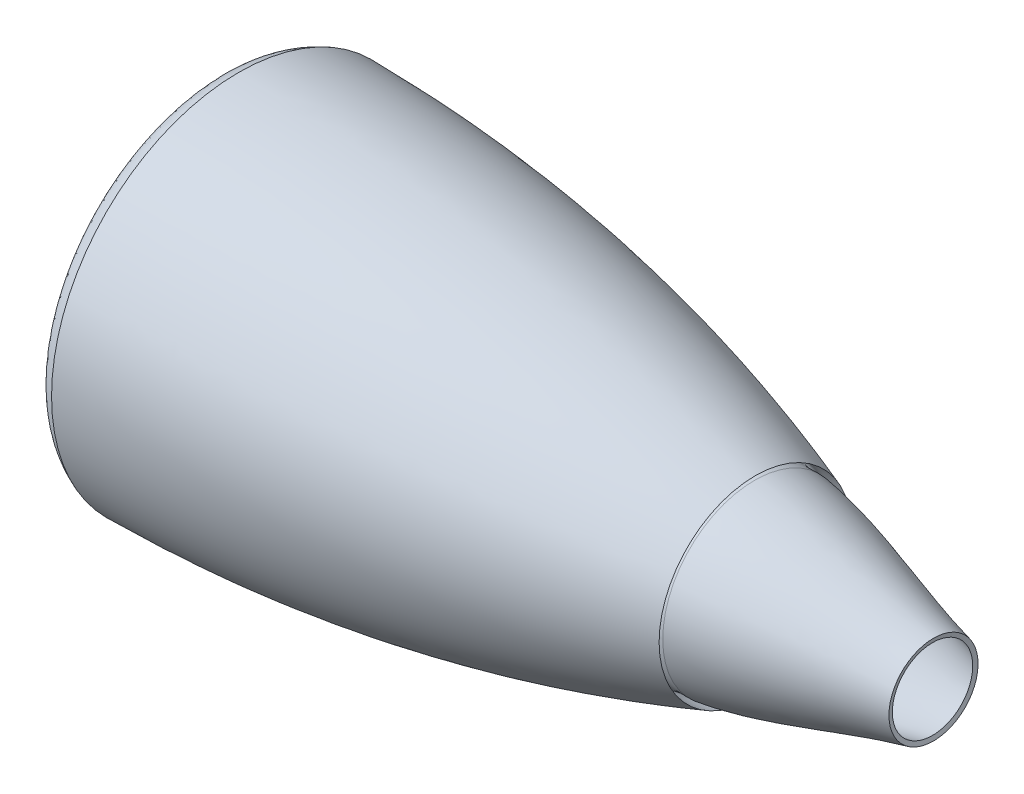
ISO-10303-21;
HEADER;
FILE_DESCRIPTION(('STEP AP214'),'2;1');
FILE_NAME('part.step','',(''),(''),'','','');
FILE_SCHEMA(('AUTOMOTIVE_DESIGN { 1 0 10303 214 1 1 1 1 }'));
ENDSEC;
DATA;
#1=APPLICATION_CONTEXT('core data for automotive mechanical design processes');
#2=APPLICATION_PROTOCOL_DEFINITION('international standard','automotive_design',2000,#1);
#3=PRODUCT_CONTEXT('',#1,'mechanical');
#4=PRODUCT('Part','Part','',(#3));
#5=PRODUCT_RELATED_PRODUCT_CATEGORY('part','',(#4));
#6=PRODUCT_DEFINITION_FORMATION('','',#4);
#7=PRODUCT_DEFINITION_CONTEXT('part definition',#1,'design');
#8=PRODUCT_DEFINITION('design','',#6,#7);
#9=PRODUCT_DEFINITION_SHAPE('','',#8);
#10=(LENGTH_UNIT() NAMED_UNIT(*) SI_UNIT(.MILLI.,.METRE.));
#11=(NAMED_UNIT(*) PLANE_ANGLE_UNIT() SI_UNIT($,.RADIAN.));
#12=(NAMED_UNIT(*) SI_UNIT($,.STERADIAN.) SOLID_ANGLE_UNIT());
#13=UNCERTAINTY_MEASURE_WITH_UNIT(LENGTH_MEASURE(1.E-05),#10,'distance_accuracy_value','');
#14=(GEOMETRIC_REPRESENTATION_CONTEXT(3) GLOBAL_UNCERTAINTY_ASSIGNED_CONTEXT((#13)) GLOBAL_UNIT_ASSIGNED_CONTEXT((#10,
#11,#12)) REPRESENTATION_CONTEXT('',''));
#15=CARTESIAN_POINT('',(0.,0.,0.));
#16=DIRECTION('',(0.,0.,1.));
#17=DIRECTION('',(1.,0.,0.));
#18=AXIS2_PLACEMENT_3D('',#15,#16,#17);
#19=CARTESIAN_POINT('',(780.,0.,0.));
#20=DIRECTION('',(1.,0.,0.));
#21=DIRECTION('',(0.,0.,-1.));
#22=AXIS2_PLACEMENT_3D('',#19,#20,#21);
#23=CONICAL_SURFACE('',#22,50.,1.35127852830754);
#24=CARTESIAN_POINT('',(778.911204907492,0.,0.));
#25=DIRECTION('',(-1.,0.,0.));
#26=DIRECTION('',(0.,1.,0.));
#27=AXIS2_PLACEMENT_3D('',#24,#25,#26);
#28=CIRCLE('',#27,45.1199871673806);
#29=CARTESIAN_POINT('',(778.911204907492,45.1199871673806,0.));
#30=VERTEX_POINT('',#29);
#31=EDGE_CURVE('E61',#30,#30,#28,.T.);
#32=ORIENTED_EDGE('',*,*,#31,.T.);
#33=EDGE_LOOP('',(#32));
#34=FACE_BOUND('',#33,.T.);
#35=CARTESIAN_POINT('',(780.,0.,0.));
#36=DIRECTION('',(-1.,0.,0.));
#37=DIRECTION('',(0.,0.,1.));
#38=AXIS2_PLACEMENT_3D('',#35,#36,#37);
#39=CIRCLE('',#38,50.);
#40=CARTESIAN_POINT('',(780.,0.,50.));
#41=VERTEX_POINT('',#40);
#42=EDGE_CURVE('E172',#41,#41,#39,.T.);
#43=ORIENTED_EDGE('',*,*,#42,.F.);
#44=EDGE_LOOP('',(#43));
#45=FACE_BOUND('',#44,.T.);
#46=ADVANCED_FACE('F43',(#34,#45),#23,.F.);
#47=CARTESIAN_POINT('',(55.,0.,0.));
#48=DIRECTION('',(1.,0.,0.));
#49=DIRECTION('',(0.,0.,-1.));
#50=AXIS2_PLACEMENT_3D('',#47,#48,#49);
#51=PLANE('',#50);
#52=CARTESIAN_POINT('',(55.,0.,0.));
#53=DIRECTION('',(-1.,0.,0.));
#54=DIRECTION('',(0.,0.,1.));
#55=AXIS2_PLACEMENT_3D('',#52,#53,#54);
#56=CIRCLE('',#55,195.);
#57=CARTESIAN_POINT('',(55.,0.,195.));
#58=VERTEX_POINT('',#57);
#59=EDGE_CURVE('E50',#58,#58,#56,.T.);
#60=ORIENTED_EDGE('',*,*,#59,.F.);
#61=EDGE_LOOP('',(#60));
#62=FACE_BOUND('',#61,.T.);
#63=CARTESIAN_POINT('',(55.,0.,0.));
#64=DIRECTION('',(-1.,0.,0.));
#65=DIRECTION('',(0.,0.,1.));
#66=AXIS2_PLACEMENT_3D('',#63,#64,#65);
#67=CIRCLE('',#66,190.);
#68=CARTESIAN_POINT('',(55.,0.,190.));
#69=VERTEX_POINT('',#68);
#70=EDGE_CURVE('E64',#69,#69,#67,.T.);
#71=ORIENTED_EDGE('',*,*,#70,.T.);
#72=EDGE_LOOP('',(#71));
#73=FACE_BOUND('',#72,.T.);
#74=ADVANCED_FACE('F140',(#62,#73),#51,.T.);
#75=CARTESIAN_POINT('',(912.992076059544,0.,0.));
#76=DIRECTION('',(-1.,0.,0.));
#77=DIRECTION('',(0.,0.,1.));
#78=AXIS2_PLACEMENT_3D('',#75,#76,#77);
#79=CYLINDRICAL_SURFACE('',#78,195.);
#80=ORIENTED_EDGE('',*,*,#59,.T.);
#81=EDGE_LOOP('',(#80));
#82=FACE_BOUND('',#81,.T.);
#83=CARTESIAN_POINT('',(26.9098300562506,0.,0.));
#84=DIRECTION('',(1.,0.,0.));
#85=DIRECTION('',(0.,0.,-1.));
#86=AXIS2_PLACEMENT_3D('',#83,#84,#85);
#87=CIRCLE('',#86,195.);
#88=CARTESIAN_POINT('',(26.9098300562506,0.,-195.));
#89=VERTEX_POINT('',#88);
#90=EDGE_CURVE('E55',#89,#89,#87,.F.);
#91=ORIENTED_EDGE('',*,*,#90,.F.);
#92=EDGE_LOOP('',(#91));
#93=FACE_BOUND('',#92,.T.);
#94=ADVANCED_FACE('F142',(#82,#93),#79,.T.);
#95=CARTESIAN_POINT('',(20.5278640450005,0.,0.));
#96=DIRECTION('',(1.,0.,0.));
#97=DIRECTION('',(0.,0.,-1.));
#98=AXIS2_PLACEMENT_3D('',#95,#96,#97);
#99=CONICAL_SURFACE('',#98,182.2360679775,1.10714871779409);
#100=ORIENTED_EDGE('',*,*,#90,.T.);
#101=EDGE_LOOP('',(#100));
#102=FACE_BOUND('',#101,.T.);
#103=CARTESIAN_POINT('',(21.9098300562506,0.,0.));
#104=DIRECTION('',(1.,0.,0.));
#105=DIRECTION('',(0.,0.,-1.));
#106=AXIS2_PLACEMENT_3D('',#103,#104,#105);
#107=CIRCLE('',#106,185.);
#108=CARTESIAN_POINT('',(21.9098300562506,0.,-185.));
#109=VERTEX_POINT('',#108);
#110=EDGE_CURVE('E193',#109,#109,#107,.F.);
#111=ORIENTED_EDGE('',*,*,#110,.F.);
#112=EDGE_LOOP('',(#111));
#113=FACE_BOUND('',#112,.T.);
#114=ADVANCED_FACE('F148',(#102,#113),#99,.T.);
#115=CARTESIAN_POINT('',(912.992076059544,0.,0.));
#116=DIRECTION('',(-1.,0.,0.));
#117=DIRECTION('',(0.,0.,1.));
#118=AXIS2_PLACEMENT_3D('',#115,#116,#117);
#119=CYLINDRICAL_SURFACE('',#118,185.);
#120=ORIENTED_EDGE('',*,*,#110,.T.);
#121=EDGE_LOOP('',(#120));
#122=FACE_BOUND('',#121,.T.);
#123=CARTESIAN_POINT('',(1.1179823000691,0.,0.));
#124=DIRECTION('',(-1.,0.,0.));
#125=DIRECTION('',(0.,0.,1.));
#126=AXIS2_PLACEMENT_3D('',#123,#124,#125);
#127=CIRCLE('',#126,185.);
#128=CARTESIAN_POINT('',(1.1179823000691,0.,185.));
#129=VERTEX_POINT('',#128);
#130=EDGE_CURVE('E196',#129,#129,#127,.T.);
#131=ORIENTED_EDGE('',*,*,#130,.F.);
#132=EDGE_LOOP('',(#131));
#133=FACE_BOUND('',#132,.T.);
#134=ADVANCED_FACE('F209',(#122,#133),#119,.T.);
#135=CARTESIAN_POINT('',(0.,210.,0.));
#136=CARTESIAN_POINT('',(-24.1611314157388,200.493204585091,0.));
#137=CARTESIAN_POINT('',(-22.5282619476755,190.459872590214,0.));
#138=CARTESIAN_POINT('',(0.,180.,0.));
#139=B_SPLINE_CURVE_WITH_KNOTS('',3,(#135,#136,#137,#138),.UNSPECIFIED.,.F.,.F.,(4,4),(0.,1.),.UNSPECIFIED.);
#140=CARTESIAN_POINT('',(912.992076059544,0.,0.));
#141=DIRECTION('',(-1.,0.,0.));
#142=AXIS1_PLACEMENT('',#140,#141);
#143=SURFACE_OF_REVOLUTION('',#139,#142);
#144=OFFSET_SURFACE('',#143,-5.,.F.);
#145=ORIENTED_EDGE('',*,*,#130,.T.);
#146=EDGE_LOOP('',(#145));
#147=FACE_BOUND('',#146,.T.);
#148=CARTESIAN_POINT('',(0.945154332400056,0.,0.));
#149=DIRECTION('',(-1.,0.,0.));
#150=DIRECTION('',(0.,0.,1.));
#151=AXIS2_PLACEMENT_3D('',#148,#149,#150);
#152=CIRCLE('',#151,204.993588308382);
#153=CARTESIAN_POINT('',(0.945154332400056,0.,204.993588308382));
#154=VERTEX_POINT('',#153);
#155=EDGE_CURVE('E200',#154,#154,#152,.T.);
#156=ORIENTED_EDGE('',*,*,#155,.F.);
#157=EDGE_LOOP('',(#156));
#158=FACE_BOUND('',#157,.T.);
#159=ADVANCED_FACE('F85',(#147,#158),#144,.F.);
#160=CARTESIAN_POINT('',(580.,108.,0.));
#161=CARTESIAN_POINT('',(299.234604177827,208.085653318227,0.));
#162=CARTESIAN_POINT('',(0.,210.,0.));
#163=B_SPLINE_CURVE_WITH_KNOTS('',2,(#160,#161,#162),.UNSPECIFIED.,.F.,.F.,(3,3),(0.,1.),.UNSPECIFIED.);
#164=CARTESIAN_POINT('',(912.992076059544,0.,0.));
#165=DIRECTION('',(-1.,0.,0.));
#166=AXIS1_PLACEMENT('',#164,#165);
#167=SURFACE_OF_REVOLUTION('',#163,#166);
#168=OFFSET_SURFACE('',#167,-5.,.F.);
#169=ORIENTED_EDGE('',*,*,#155,.T.);
#170=EDGE_LOOP('',(#169));
#171=FACE_BOUND('',#170,.T.);
#172=CARTESIAN_POINT('',(554.072496528048,0.,0.));
#173=DIRECTION('',(-1.,0.,0.));
#174=DIRECTION('',(0.,0.,1.));
#175=AXIS2_PLACEMENT_3D('',#172,#173,#174);
#176=CIRCLE('',#175,111.738968333362);
#177=CARTESIAN_POINT('',(554.072496528048,0.,111.738968333362));
#178=VERTEX_POINT('',#177);
#179=EDGE_CURVE('E58',#178,#178,#176,.T.);
#180=ORIENTED_EDGE('',*,*,#179,.F.);
#181=EDGE_LOOP('',(#180));
#182=FACE_BOUND('',#181,.T.);
#183=ADVANCED_FACE('F87',(#171,#182),#168,.F.);
#184=CARTESIAN_POINT('',(578.887151871726,103.007894598598,0.));
#185=CARTESIAN_POINT('',(576.557180346548,103.012182502718,0.));
#186=CARTESIAN_POINT('',(554.55199715213,101.036039581016,0.));
#187=CARTESIAN_POINT('',(555.091735760706,110.460684099647,0.));
#188=CARTESIAN_POINT('',(577.741223314922,108.635380513684,0.));
#189=CARTESIAN_POINT('',(580.,108.,0.));
#190=B_SPLINE_CURVE_WITH_KNOTS('',3,(#184,#185,#186,#187,#188,#189),.UNSPECIFIED.,.F.,.F.,(4,1,
1,4),(0.0160920331350331,0.435842984677015,0.535842984677015,1.),.UNSPECIFIED.);
#191=CARTESIAN_POINT('',(912.992076059544,0.,0.));
#192=DIRECTION('',(-1.,0.,0.));
#193=AXIS1_PLACEMENT('',#191,#192);
#194=SURFACE_OF_REVOLUTION('',#190,#193);
#195=OFFSET_SURFACE('',#194,-5.,.F.);
#196=CARTESIAN_POINT('',(578.736591529912,0.,0.));
#197=DIRECTION('',(-1.,0.,0.));
#198=DIRECTION('',(0.,0.,1.));
#199=AXIS2_PLACEMENT_3D('',#196,#197,#198);
#200=CIRCLE('',#199,98.0049639084596);
#201=CARTESIAN_POINT('',(578.736591529912,0.,98.0049639084596));
#202=VERTEX_POINT('',#201);
#203=EDGE_CURVE('E12',#202,#202,#200,.T.);
#204=ORIENTED_EDGE('',*,*,#203,.F.);
#205=EDGE_LOOP('',(#204));
#206=FACE_BOUND('',#205,.T.);
#207=ORIENTED_EDGE('',*,*,#179,.T.);
#208=EDGE_LOOP('',(#207));
#209=FACE_BOUND('',#208,.T.);
#210=ADVANCED_FACE('F90',(#206,#209),#195,.F.);
#211=CARTESIAN_POINT('',(780.,50.,0.));
#212=CARTESIAN_POINT('',(719.731505564093,63.4466943480266,0.));
#213=CARTESIAN_POINT('',(639.634560453513,95.5270520764592,0.));
#214=CARTESIAN_POINT('',(579.085351414629,103.,0.));
#215=B_SPLINE_CURVE_WITH_KNOTS('',3,(#211,#212,#213,#214),.UNSPECIFIED.,.F.,.F.,(4,4),(0.,1.),.UNSPECIFIED.);
#216=CARTESIAN_POINT('',(912.992076059544,0.,0.));
#217=DIRECTION('',(-1.,0.,0.));
#218=AXIS1_PLACEMENT('',#216,#217);
#219=SURFACE_OF_REVOLUTION('',#215,#218);
#220=OFFSET_SURFACE('',#219,-5.,.F.);
#221=ORIENTED_EDGE('',*,*,#203,.T.);
#222=EDGE_LOOP('',(#221));
#223=FACE_BOUND('',#222,.T.);
#224=ORIENTED_EDGE('',*,*,#31,.F.);
#225=EDGE_LOOP('',(#224));
#226=FACE_BOUND('',#225,.T.);
#227=ADVANCED_FACE('F99',(#223,#226),#220,.F.);
#228=CARTESIAN_POINT('',(912.992076059544,0.,0.));
#229=DIRECTION('',(-1.,0.,0.));
#230=DIRECTION('',(0.,0.,1.));
#231=AXIS2_PLACEMENT_3D('',#228,#229,#230);
#232=CYLINDRICAL_SURFACE('',#231,190.);
#233=ORIENTED_EDGE('',*,*,#70,.F.);
#234=EDGE_LOOP('',(#233));
#235=FACE_BOUND('',#234,.T.);
#236=CARTESIAN_POINT('',(30.,0.,0.));
#237=DIRECTION('',(-1.,0.,0.));
#238=DIRECTION('',(0.,0.,1.));
#239=AXIS2_PLACEMENT_3D('',#236,#237,#238);
#240=CIRCLE('',#239,190.);
#241=CARTESIAN_POINT('',(30.,0.,190.));
#242=VERTEX_POINT('',#241);
#243=EDGE_CURVE('E46',#242,#242,#240,.T.);
#244=ORIENTED_EDGE('',*,*,#243,.T.);
#245=EDGE_LOOP('',(#244));
#246=FACE_BOUND('',#245,.T.);
#247=ADVANCED_FACE('F136',(#235,#246),#232,.F.);
#248=CARTESIAN_POINT('',(25.,0.,0.));
#249=DIRECTION('',(1.,0.,0.));
#250=DIRECTION('',(0.,0.,-1.));
#251=AXIS2_PLACEMENT_3D('',#248,#249,#250);
#252=CONICAL_SURFACE('',#251,180.,1.10714871779409);
#253=ORIENTED_EDGE('',*,*,#243,.F.);
#254=EDGE_LOOP('',(#253));
#255=FACE_BOUND('',#254,.T.);
#256=CARTESIAN_POINT('',(25.,0.,0.));
#257=DIRECTION('',(-1.,0.,0.));
#258=DIRECTION('',(0.,0.,1.));
#259=AXIS2_PLACEMENT_3D('',#256,#257,#258);
#260=CIRCLE('',#259,180.);
#261=CARTESIAN_POINT('',(25.,0.,180.));
#262=VERTEX_POINT('',#261);
#263=EDGE_CURVE('E157',#262,#262,#260,.T.);
#264=ORIENTED_EDGE('',*,*,#263,.T.);
#265=EDGE_LOOP('',(#264));
#266=FACE_BOUND('',#265,.T.);
#267=ADVANCED_FACE('F132',(#255,#266),#252,.F.);
#268=CARTESIAN_POINT('',(912.992076059544,0.,0.));
#269=DIRECTION('',(-1.,0.,0.));
#270=DIRECTION('',(0.,0.,1.));
#271=AXIS2_PLACEMENT_3D('',#268,#269,#270);
#272=CYLINDRICAL_SURFACE('',#271,180.);
#273=ORIENTED_EDGE('',*,*,#263,.F.);
#274=EDGE_LOOP('',(#273));
#275=FACE_BOUND('',#274,.T.);
#276=CARTESIAN_POINT('',(0.,0.,0.));
#277=DIRECTION('',(-1.,0.,0.));
#278=DIRECTION('',(0.,0.,1.));
#279=AXIS2_PLACEMENT_3D('',#276,#277,#278);
#280=CIRCLE('',#279,180.);
#281=CARTESIAN_POINT('',(0.,0.,180.));
#282=VERTEX_POINT('',#281);
#283=EDGE_CURVE('E161',#282,#282,#280,.T.);
#284=ORIENTED_EDGE('',*,*,#283,.T.);
#285=EDGE_LOOP('',(#284));
#286=FACE_BOUND('',#285,.T.);
#287=ADVANCED_FACE('F83',(#275,#286),#272,.F.);
#288=CARTESIAN_POINT('',(0.,210.,0.));
#289=CARTESIAN_POINT('',(-24.1611314157388,200.493204585091,0.));
#290=CARTESIAN_POINT('',(-22.5282619476755,190.459872590214,0.));
#291=CARTESIAN_POINT('',(0.,180.,0.));
#292=B_SPLINE_CURVE_WITH_KNOTS('',3,(#288,#289,#290,#291),.UNSPECIFIED.,.F.,.F.,(4,4),(0.,1.),.UNSPECIFIED.);
#293=CARTESIAN_POINT('',(912.992076059544,0.,0.));
#294=DIRECTION('',(-1.,0.,0.));
#295=AXIS1_PLACEMENT('',#293,#294);
#296=SURFACE_OF_REVOLUTION('',#292,#295);
#297=ORIENTED_EDGE('',*,*,#283,.F.);
#298=EDGE_LOOP('',(#297));
#299=FACE_BOUND('',#298,.T.);
#300=CARTESIAN_POINT('',(0.,0.,0.));
#301=DIRECTION('',(-1.,0.,0.));
#302=DIRECTION('',(0.,0.,1.));
#303=AXIS2_PLACEMENT_3D('',#300,#301,#302);
#304=CIRCLE('',#303,210.);
#305=CARTESIAN_POINT('',(0.,0.,210.));
#306=VERTEX_POINT('',#305);
#307=EDGE_CURVE('E164',#306,#306,#304,.T.);
#308=ORIENTED_EDGE('',*,*,#307,.T.);
#309=EDGE_LOOP('',(#308));
#310=FACE_BOUND('',#309,.T.);
#311=ADVANCED_FACE('F77',(#299,#310),#296,.T.);
#312=CARTESIAN_POINT('',(580.,108.,0.));
#313=CARTESIAN_POINT('',(299.234604177827,208.085653318227,0.));
#314=CARTESIAN_POINT('',(0.,210.,0.));
#315=B_SPLINE_CURVE_WITH_KNOTS('',2,(#312,#313,#314),.UNSPECIFIED.,.F.,.F.,(3,3),(0.,1.),.UNSPECIFIED.);
#316=CARTESIAN_POINT('',(912.992076059544,0.,0.));
#317=DIRECTION('',(-1.,0.,0.));
#318=AXIS1_PLACEMENT('',#316,#317);
#319=SURFACE_OF_REVOLUTION('',#315,#318);
#320=ORIENTED_EDGE('',*,*,#307,.F.);
#321=EDGE_LOOP('',(#320));
#322=FACE_BOUND('',#321,.T.);
#323=CARTESIAN_POINT('',(580.,0.,0.));
#324=DIRECTION('',(-1.,0.,0.));
#325=DIRECTION('',(0.,0.,1.));
#326=AXIS2_PLACEMENT_3D('',#323,#324,#325);
#327=CIRCLE('',#326,108.);
#328=CARTESIAN_POINT('',(580.,0.,108.));
#329=VERTEX_POINT('',#328);
#330=EDGE_CURVE('E167',#329,#329,#327,.T.);
#331=ORIENTED_EDGE('',*,*,#330,.T.);
#332=EDGE_LOOP('',(#331));
#333=FACE_BOUND('',#332,.T.);
#334=ADVANCED_FACE('F82',(#322,#333),#319,.T.);
#335=CARTESIAN_POINT('',(579.085351414629,103.,0.));
#336=CARTESIAN_POINT('',(577.941154504853,103.141216112593,0.));
#337=CARTESIAN_POINT('',(554.543169607414,100.881897428511,0.));
#338=CARTESIAN_POINT('',(555.091735760706,110.460684099647,0.));
#339=CARTESIAN_POINT('',(577.741223314922,108.635380513684,0.));
#340=CARTESIAN_POINT('',(580.,108.,0.));
#341=B_SPLINE_CURVE_WITH_KNOTS('',3,(#335,#336,#337,#338,#339,#340),.UNSPECIFIED.,.F.,.F.,(4,1,
1,4),(0.,0.435842984677015,0.535842984677015,1.),.UNSPECIFIED.);
#342=CARTESIAN_POINT('',(912.992076059544,0.,0.));
#343=DIRECTION('',(-1.,0.,0.));
#344=AXIS1_PLACEMENT('',#342,#343);
#345=SURFACE_OF_REVOLUTION('',#341,#344);
#346=ORIENTED_EDGE('',*,*,#330,.F.);
#347=EDGE_LOOP('',(#346));
#348=FACE_BOUND('',#347,.T.);
#349=CARTESIAN_POINT('',(579.085351414629,0.,0.));
#350=DIRECTION('',(-1.,0.,0.));
#351=DIRECTION('',(0.,0.,1.));
#352=AXIS2_PLACEMENT_3D('',#349,#350,#351);
#353=CIRCLE('',#352,103.);
#354=CARTESIAN_POINT('',(579.085351414629,0.,103.));
#355=VERTEX_POINT('',#354);
#356=EDGE_CURVE('E170',#355,#355,#353,.T.);
#357=ORIENTED_EDGE('',*,*,#356,.T.);
#358=EDGE_LOOP('',(#357));
#359=FACE_BOUND('',#358,.T.);
#360=ADVANCED_FACE('F95',(#348,#359),#345,.T.);
#361=CARTESIAN_POINT('',(780.,50.,0.));
#362=CARTESIAN_POINT('',(719.731505564093,63.4466943480266,0.));
#363=CARTESIAN_POINT('',(639.634560453513,95.5270520764592,0.));
#364=CARTESIAN_POINT('',(579.085351414629,103.,0.));
#365=B_SPLINE_CURVE_WITH_KNOTS('',3,(#361,#362,#363,#364),.UNSPECIFIED.,.F.,.F.,(4,4),(0.,1.),.UNSPECIFIED.);
#366=CARTESIAN_POINT('',(912.992076059544,0.,0.));
#367=DIRECTION('',(-1.,0.,0.));
#368=AXIS1_PLACEMENT('',#366,#367);
#369=SURFACE_OF_REVOLUTION('',#365,#368);
#370=ORIENTED_EDGE('',*,*,#356,.F.);
#371=EDGE_LOOP('',(#370));
#372=FACE_BOUND('',#371,.T.);
#373=ORIENTED_EDGE('',*,*,#42,.T.);
#374=EDGE_LOOP('',(#373));
#375=FACE_BOUND('',#374,.T.);
#376=ADVANCED_FACE('F122',(#372,#375),#369,.T.);
#377=CLOSED_SHELL('',(#46,#74,#94,#114,#134,#159,#183,#210,#227,#247,#267,#287,#311,#334,#360,#376));
#378=MANIFOLD_SOLID_BREP('B2',#377);
#379=ADVANCED_BREP_SHAPE_REPRESENTATION('',(#18,#378),#14);
#380=SHAPE_DEFINITION_REPRESENTATION(#9,#379);
ENDSEC;
END-ISO-10303-21;
